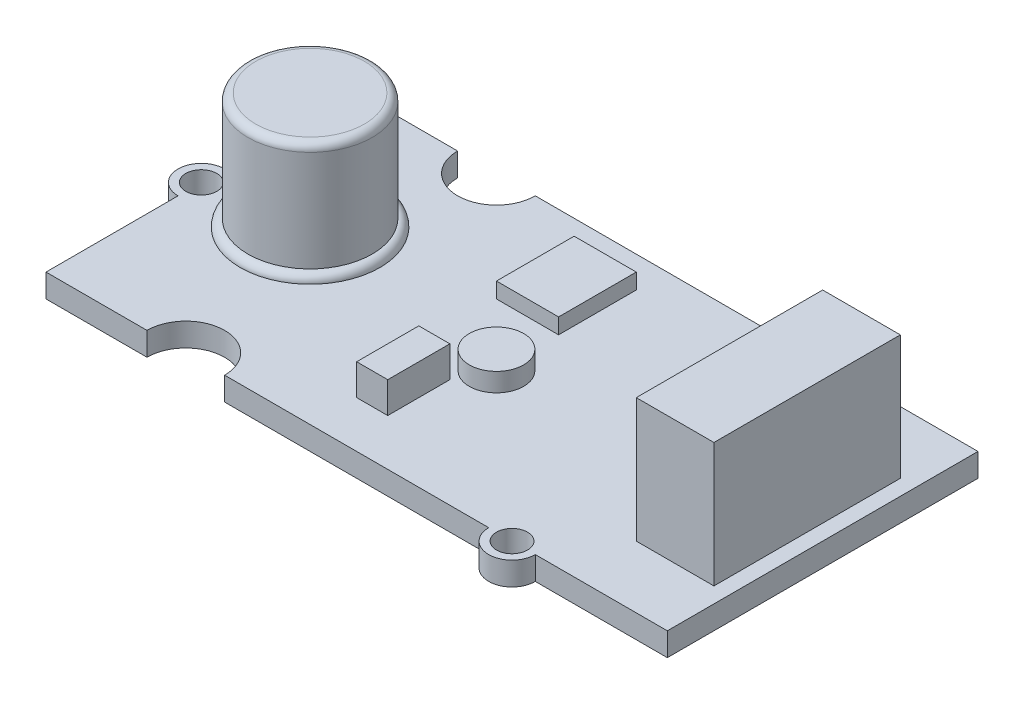
ISO-10303-21;
HEADER;
FILE_DESCRIPTION(('STEP AP214'),'2;1');
FILE_NAME('part.step','',(''),(''),'','','');
FILE_SCHEMA(('AUTOMOTIVE_DESIGN { 1 0 10303 214 1 1 1 1 }'));
ENDSEC;
DATA;
#1=APPLICATION_CONTEXT('core data for automotive mechanical design processes');
#2=APPLICATION_PROTOCOL_DEFINITION('international standard','automotive_design',2000,#1);
#3=PRODUCT_CONTEXT('',#1,'mechanical');
#4=PRODUCT('Part','Part','',(#3));
#5=PRODUCT_RELATED_PRODUCT_CATEGORY('part','',(#4));
#6=PRODUCT_DEFINITION_FORMATION('','',#4);
#7=PRODUCT_DEFINITION_CONTEXT('part definition',#1,'design');
#8=PRODUCT_DEFINITION('design','',#6,#7);
#9=PRODUCT_DEFINITION_SHAPE('','',#8);
#10=(LENGTH_UNIT() NAMED_UNIT(*) SI_UNIT(.MILLI.,.METRE.));
#11=(NAMED_UNIT(*) PLANE_ANGLE_UNIT() SI_UNIT($,.RADIAN.));
#12=(NAMED_UNIT(*) SI_UNIT($,.STERADIAN.) SOLID_ANGLE_UNIT());
#13=UNCERTAINTY_MEASURE_WITH_UNIT(LENGTH_MEASURE(1.E-05),#10,'distance_accuracy_value','');
#14=(GEOMETRIC_REPRESENTATION_CONTEXT(3) GLOBAL_UNCERTAINTY_ASSIGNED_CONTEXT((#13)) GLOBAL_UNIT_ASSIGNED_CONTEXT((#10,
#11,#12)) REPRESENTATION_CONTEXT('',''));
#15=CARTESIAN_POINT('',(0.,0.,0.));
#16=DIRECTION('',(0.,0.,1.));
#17=DIRECTION('',(1.,0.,0.));
#18=AXIS2_PLACEMENT_3D('',#15,#16,#17);
#19=CARTESIAN_POINT('',(0.,1.5,0.));
#20=DIRECTION('',(0.,1.,0.));
#21=DIRECTION('',(0.,0.,1.));
#22=AXIS2_PLACEMENT_3D('',#19,#20,#21);
#23=PLANE('',#22);
#24=CARTESIAN_POINT('',(0.,1.5,0.999999999999997));
#25=DIRECTION('',(0.,1.,0.));
#26=DIRECTION('',(0.,0.,1.));
#27=AXIS2_PLACEMENT_3D('',#24,#25,#26);
#28=CIRCLE('',#27,1.75);
#29=CARTESIAN_POINT('',(0.,1.5,2.75));
#30=VERTEX_POINT('',#29);
#31=EDGE_CURVE('E233',#30,#30,#28,.T.);
#32=ORIENTED_EDGE('',*,*,#31,.F.);
#33=EDGE_LOOP('',(#32));
#34=FACE_BOUND('',#33,.T.);
#35=CARTESIAN_POINT('',(-14.,1.5,-1.));
#36=DIRECTION('',(0.,1.,0.));
#37=DIRECTION('',(0.,0.,1.));
#38=AXIS2_PLACEMENT_3D('',#35,#36,#37);
#39=CIRCLE('',#38,4.5);
#40=CARTESIAN_POINT('',(-14.,1.5,3.5));
#41=VERTEX_POINT('',#40);
#42=EDGE_CURVE('E302',#41,#41,#39,.T.);
#43=ORIENTED_EDGE('',*,*,#42,.F.);
#44=EDGE_LOOP('',(#43));
#45=FACE_BOUND('',#44,.T.);
#46=CARTESIAN_POINT('',(10.,1.5,10.));
#47=DIRECTION('',(0.,1.,0.));
#48=DIRECTION('',(0.,0.,1.));
#49=AXIS2_PLACEMENT_3D('',#46,#47,#48);
#50=CIRCLE('',#49,0.999999999999999);
#51=CARTESIAN_POINT('',(10.,1.5,11.));
#52=VERTEX_POINT('',#51);
#53=EDGE_CURVE('E305',#52,#52,#50,.T.);
#54=ORIENTED_EDGE('',*,*,#53,.F.);
#55=EDGE_LOOP('',(#54));
#56=FACE_BOUND('',#55,.T.);
#57=CARTESIAN_POINT('',(10.,1.5,-10.));
#58=DIRECTION('',(0.,1.,0.));
#59=DIRECTION('',(0.,0.,1.));
#60=AXIS2_PLACEMENT_3D('',#57,#58,#59);
#61=CIRCLE('',#60,0.999999999999999);
#62=CARTESIAN_POINT('',(10.,1.5,-9.));
#63=VERTEX_POINT('',#62);
#64=EDGE_CURVE('E309',#63,#63,#61,.T.);
#65=ORIENTED_EDGE('',*,*,#64,.F.);
#66=EDGE_LOOP('',(#65));
#67=FACE_BOUND('',#66,.T.);
#68=DIRECTION('',(1.,0.,0.));
#69=VECTOR('',#68,1.);
#70=CARTESIAN_POINT('',(-20.,1.5,10.));
#71=LINE('',#70,#69);
#72=CARTESIAN_POINT('',(-8.5,1.5,10.));
#73=VERTEX_POINT('',#72);
#74=CARTESIAN_POINT('',(8.5,1.5,10.));
#75=VERTEX_POINT('',#74);
#76=EDGE_CURVE('E393',#73,#75,#71,.T.);
#77=ORIENTED_EDGE('',*,*,#76,.T.);
#78=CARTESIAN_POINT('',(10.,1.5,10.));
#79=DIRECTION('',(0.,1.,0.));
#80=DIRECTION('',(0.,0.,1.));
#81=AXIS2_PLACEMENT_3D('',#78,#79,#80);
#82=CIRCLE('',#81,1.5);
#83=CARTESIAN_POINT('',(11.5,1.5,10.));
#84=VERTEX_POINT('',#83);
#85=EDGE_CURVE('E315',#75,#84,#82,.T.);
#86=ORIENTED_EDGE('',*,*,#85,.T.);
#87=CARTESIAN_POINT('',(20.,1.5,10.));
#88=VERTEX_POINT('',#87);
#89=EDGE_CURVE('E388',#84,#88,#71,.T.);
#90=ORIENTED_EDGE('',*,*,#89,.T.);
#91=DIRECTION('',(0.,0.,-1.));
#92=VECTOR('',#91,1.);
#93=CARTESIAN_POINT('',(20.,1.5,-10.));
#94=LINE('',#93,#92);
#95=CARTESIAN_POINT('',(20.,1.5,-10.));
#96=VERTEX_POINT('',#95);
#97=EDGE_CURVE('E375',#88,#96,#94,.T.);
#98=ORIENTED_EDGE('',*,*,#97,.T.);
#99=DIRECTION('',(-1.,0.,0.));
#100=VECTOR('',#99,1.);
#101=CARTESIAN_POINT('',(-20.,1.5,-10.));
#102=LINE('',#101,#100);
#103=CARTESIAN_POINT('',(11.5,1.5,-10.));
#104=VERTEX_POINT('',#103);
#105=EDGE_CURVE('E380',#96,#104,#102,.T.);
#106=ORIENTED_EDGE('',*,*,#105,.T.);
#107=CARTESIAN_POINT('',(10.,1.5,-10.));
#108=DIRECTION('',(0.,1.,0.));
#109=DIRECTION('',(0.,0.,1.));
#110=AXIS2_PLACEMENT_3D('',#107,#108,#109);
#111=CIRCLE('',#110,1.5);
#112=CARTESIAN_POINT('',(8.5,1.5,-10.));
#113=VERTEX_POINT('',#112);
#114=EDGE_CURVE('E327',#104,#113,#111,.T.);
#115=ORIENTED_EDGE('',*,*,#114,.T.);
#116=CARTESIAN_POINT('',(-8.5,1.5,-10.));
#117=VERTEX_POINT('',#116);
#118=EDGE_CURVE('E384',#113,#117,#102,.T.);
#119=ORIENTED_EDGE('',*,*,#118,.T.);
#120=CARTESIAN_POINT('',(-11.,1.5,-10.));
#121=DIRECTION('',(0.,-1.,0.));
#122=DIRECTION('',(0.,0.,-1.));
#123=AXIS2_PLACEMENT_3D('',#120,#121,#122);
#124=CIRCLE('',#123,2.5);
#125=CARTESIAN_POINT('',(-13.5,1.5,-10.));
#126=VERTEX_POINT('',#125);
#127=EDGE_CURVE('E347',#117,#126,#124,.T.);
#128=ORIENTED_EDGE('',*,*,#127,.T.);
#129=CARTESIAN_POINT('',(-20.,1.5,-10.));
#130=VERTEX_POINT('',#129);
#131=EDGE_CURVE('E378',#126,#130,#102,.T.);
#132=ORIENTED_EDGE('',*,*,#131,.T.);
#133=DIRECTION('',(0.,0.,1.));
#134=VECTOR('',#133,1.);
#135=CARTESIAN_POINT('',(-20.,1.5,-10.));
#136=LINE('',#135,#134);
#137=CARTESIAN_POINT('',(-20.,1.5,-1.5));
#138=VERTEX_POINT('',#137);
#139=EDGE_CURVE('E385',#130,#138,#136,.T.);
#140=ORIENTED_EDGE('',*,*,#139,.T.);
#141=CARTESIAN_POINT('',(-20.,1.5,0.));
#142=DIRECTION('',(0.,-1.,0.));
#143=DIRECTION('',(0.,0.,-1.));
#144=AXIS2_PLACEMENT_3D('',#141,#142,#143);
#145=CIRCLE('',#144,1.5);
#146=CARTESIAN_POINT('',(-20.,1.5,1.5));
#147=VERTEX_POINT('',#146);
#148=EDGE_CURVE('E364',#147,#138,#145,.T.);
#149=ORIENTED_EDGE('',*,*,#148,.F.);
#150=CARTESIAN_POINT('',(-20.,1.5,10.));
#151=VERTEX_POINT('',#150);
#152=EDGE_CURVE('E383',#147,#151,#136,.T.);
#153=ORIENTED_EDGE('',*,*,#152,.T.);
#154=CARTESIAN_POINT('',(-13.5,1.5,10.));
#155=VERTEX_POINT('',#154);
#156=EDGE_CURVE('E389',#151,#155,#71,.T.);
#157=ORIENTED_EDGE('',*,*,#156,.T.);
#158=CARTESIAN_POINT('',(-11.,1.5,10.));
#159=DIRECTION('',(0.,-1.,0.));
#160=DIRECTION('',(0.,0.,-1.));
#161=AXIS2_PLACEMENT_3D('',#158,#159,#160);
#162=CIRCLE('',#161,2.5);
#163=EDGE_CURVE('E337',#155,#73,#162,.T.);
#164=ORIENTED_EDGE('',*,*,#163,.T.);
#165=EDGE_LOOP('',(#77,#86,#90,#98,#106,#115,#119,#128,#132,#140,#149,#153,#157,#164));
#166=FACE_BOUND('',#165,.T.);
#167=CARTESIAN_POINT('',(-20.,1.5,0.));
#168=DIRECTION('',(0.,-1.,0.));
#169=DIRECTION('',(0.,0.,-1.));
#170=AXIS2_PLACEMENT_3D('',#167,#168,#169);
#171=CIRCLE('',#170,1.);
#172=CARTESIAN_POINT('',(-20.,1.5,-1.));
#173=VERTEX_POINT('',#172);
#174=EDGE_CURVE('E358',#173,#173,#171,.T.);
#175=ORIENTED_EDGE('',*,*,#174,.T.);
#176=EDGE_LOOP('',(#175));
#177=FACE_BOUND('',#176,.T.);
#178=DIRECTION('',(-1.,0.,0.));
#179=VECTOR('',#178,1.);
#180=CARTESIAN_POINT('',(14.,1.5,-6.));
#181=LINE('',#180,#179);
#182=CARTESIAN_POINT('',(19.,1.5,-6.));
#183=VERTEX_POINT('',#182);
#184=CARTESIAN_POINT('',(14.,1.5,-6.));
#185=VERTEX_POINT('',#184);
#186=EDGE_CURVE('E284',#183,#185,#181,.T.);
#187=ORIENTED_EDGE('',*,*,#186,.F.);
#188=DIRECTION('',(0.,0.,-1.));
#189=VECTOR('',#188,1.);
#190=CARTESIAN_POINT('',(19.,1.5,-6.));
#191=LINE('',#190,#189);
#192=CARTESIAN_POINT('',(19.,1.5,6.));
#193=VERTEX_POINT('',#192);
#194=EDGE_CURVE('E270',#193,#183,#191,.T.);
#195=ORIENTED_EDGE('',*,*,#194,.F.);
#196=DIRECTION('',(1.,0.,0.));
#197=VECTOR('',#196,1.);
#198=CARTESIAN_POINT('',(14.,1.5,6.));
#199=LINE('',#198,#197);
#200=CARTESIAN_POINT('',(14.,1.5,6.));
#201=VERTEX_POINT('',#200);
#202=EDGE_CURVE('E275',#201,#193,#199,.T.);
#203=ORIENTED_EDGE('',*,*,#202,.F.);
#204=DIRECTION('',(0.,0.,1.));
#205=VECTOR('',#204,1.);
#206=CARTESIAN_POINT('',(14.,1.5,-6.));
#207=LINE('',#206,#205);
#208=EDGE_CURVE('E286',#185,#201,#207,.T.);
#209=ORIENTED_EDGE('',*,*,#208,.F.);
#210=EDGE_LOOP('',(#187,#195,#203,#209));
#211=FACE_BOUND('',#210,.T.);
#212=DIRECTION('',(-1.,0.,0.));
#213=VECTOR('',#212,1.);
#214=CARTESIAN_POINT('',(-4.,1.5,-8.));
#215=LINE('',#214,#213);
#216=CARTESIAN_POINT('',(0.,1.5,-8.));
#217=VERTEX_POINT('',#216);
#218=CARTESIAN_POINT('',(-4.,1.5,-8.));
#219=VERTEX_POINT('',#218);
#220=EDGE_CURVE('E257',#217,#219,#215,.T.);
#221=ORIENTED_EDGE('',*,*,#220,.F.);
#222=DIRECTION('',(0.,0.,-1.));
#223=VECTOR('',#222,1.);
#224=CARTESIAN_POINT('',(0.,1.5,-8.));
#225=LINE('',#224,#223);
#226=CARTESIAN_POINT('',(0.,1.5,-3.));
#227=VERTEX_POINT('',#226);
#228=EDGE_CURVE('E242',#227,#217,#225,.T.);
#229=ORIENTED_EDGE('',*,*,#228,.F.);
#230=DIRECTION('',(1.,0.,0.));
#231=VECTOR('',#230,1.);
#232=CARTESIAN_POINT('',(-4.,1.5,-3.));
#233=LINE('',#232,#231);
#234=CARTESIAN_POINT('',(-4.,1.5,-3.));
#235=VERTEX_POINT('',#234);
#236=EDGE_CURVE('E248',#235,#227,#233,.T.);
#237=ORIENTED_EDGE('',*,*,#236,.F.);
#238=DIRECTION('',(0.,0.,1.));
#239=VECTOR('',#238,1.);
#240=CARTESIAN_POINT('',(-4.,1.5,-8.));
#241=LINE('',#240,#239);
#242=EDGE_CURVE('E259',#219,#235,#241,.T.);
#243=ORIENTED_EDGE('',*,*,#242,.F.);
#244=EDGE_LOOP('',(#221,#229,#237,#243));
#245=FACE_BOUND('',#244,.T.);
#246=DIRECTION('',(-1.,0.,0.));
#247=VECTOR('',#246,1.);
#248=CARTESIAN_POINT('',(-3.,1.5,3.));
#249=LINE('',#248,#247);
#250=CARTESIAN_POINT('',(-0.999999999999997,1.5,3.));
#251=VERTEX_POINT('',#250);
#252=CARTESIAN_POINT('',(-3.,1.5,3.));
#253=VERTEX_POINT('',#252);
#254=EDGE_CURVE('E544',#251,#253,#249,.T.);
#255=ORIENTED_EDGE('',*,*,#254,.F.);
#256=DIRECTION('',(0.,0.,-1.));
#257=VECTOR('',#256,1.);
#258=CARTESIAN_POINT('',(-0.999999999999997,1.5,3.));
#259=LINE('',#258,#257);
#260=CARTESIAN_POINT('',(-0.999999999999997,1.5,7.));
#261=VERTEX_POINT('',#260);
#262=EDGE_CURVE('E231',#261,#251,#259,.T.);
#263=ORIENTED_EDGE('',*,*,#262,.F.);
#264=DIRECTION('',(1.,0.,0.));
#265=VECTOR('',#264,1.);
#266=CARTESIAN_POINT('',(-3.,1.5,7.));
#267=LINE('',#266,#265);
#268=CARTESIAN_POINT('',(-3.,1.5,7.));
#269=VERTEX_POINT('',#268);
#270=EDGE_CURVE('E227',#269,#261,#267,.T.);
#271=ORIENTED_EDGE('',*,*,#270,.F.);
#272=DIRECTION('',(0.,0.,1.));
#273=VECTOR('',#272,1.);
#274=CARTESIAN_POINT('',(-3.,1.5,3.));
#275=LINE('',#274,#273);
#276=EDGE_CURVE('E546',#253,#269,#275,.T.);
#277=ORIENTED_EDGE('',*,*,#276,.F.);
#278=EDGE_LOOP('',(#255,#263,#271,#277));
#279=FACE_BOUND('',#278,.T.);
#280=ADVANCED_FACE('F34',(#34,#45,#56,#67,#166,#177,#211,#245,#279),#23,.T.);
#281=CARTESIAN_POINT('',(-20.,1.5,10.));
#282=DIRECTION('',(0.,0.,-1.));
#283=DIRECTION('',(-1.,0.,0.));
#284=AXIS2_PLACEMENT_3D('',#281,#282,#283);
#285=PLANE('',#284);
#286=DIRECTION('',(1.,0.,0.));
#287=VECTOR('',#286,1.);
#288=CARTESIAN_POINT('',(-20.,0.,10.));
#289=LINE('',#288,#287);
#290=CARTESIAN_POINT('',(-8.5,0.,10.));
#291=VERTEX_POINT('',#290);
#292=CARTESIAN_POINT('',(8.5,0.,10.));
#293=VERTEX_POINT('',#292);
#294=EDGE_CURVE('E407',#291,#293,#289,.T.);
#295=ORIENTED_EDGE('',*,*,#294,.T.);
#296=DIRECTION('',(0.,1.,0.));
#297=VECTOR('',#296,1.);
#298=CARTESIAN_POINT('',(8.5,0.,10.));
#299=LINE('',#298,#297);
#300=EDGE_CURVE('E324',#293,#75,#299,.T.);
#301=ORIENTED_EDGE('',*,*,#300,.T.);
#302=ORIENTED_EDGE('',*,*,#76,.F.);
#303=DIRECTION('',(0.,-1.,0.));
#304=VECTOR('',#303,1.);
#305=CARTESIAN_POINT('',(-8.5,1.5,10.));
#306=LINE('',#305,#304);
#307=EDGE_CURVE('E343',#73,#291,#306,.T.);
#308=ORIENTED_EDGE('',*,*,#307,.T.);
#309=EDGE_LOOP('',(#295,#301,#302,#308));
#310=FACE_BOUND('',#309,.T.);
#311=ADVANCED_FACE('F440',(#310),#285,.F.);
#312=CARTESIAN_POINT('',(-20.,1.5,-10.));
#313=DIRECTION('',(0.,0.,1.));
#314=DIRECTION('',(1.,0.,0.));
#315=AXIS2_PLACEMENT_3D('',#312,#313,#314);
#316=PLANE('',#315);
#317=DIRECTION('',(-1.,0.,0.));
#318=VECTOR('',#317,1.);
#319=CARTESIAN_POINT('',(-20.,0.,-10.));
#320=LINE('',#319,#318);
#321=CARTESIAN_POINT('',(20.,0.,-10.));
#322=VERTEX_POINT('',#321);
#323=CARTESIAN_POINT('',(11.5,0.,-10.));
#324=VERTEX_POINT('',#323);
#325=EDGE_CURVE('E397',#322,#324,#320,.T.);
#326=ORIENTED_EDGE('',*,*,#325,.T.);
#327=DIRECTION('',(0.,1.,0.));
#328=VECTOR('',#327,1.);
#329=CARTESIAN_POINT('',(11.5,0.,-10.));
#330=LINE('',#329,#328);
#331=EDGE_CURVE('E334',#324,#104,#330,.T.);
#332=ORIENTED_EDGE('',*,*,#331,.T.);
#333=ORIENTED_EDGE('',*,*,#105,.F.);
#334=DIRECTION('',(0.,-1.,0.));
#335=VECTOR('',#334,1.);
#336=CARTESIAN_POINT('',(20.,1.5,-10.));
#337=LINE('',#336,#335);
#338=EDGE_CURVE('E416',#96,#322,#337,.T.);
#339=ORIENTED_EDGE('',*,*,#338,.T.);
#340=EDGE_LOOP('',(#326,#332,#333,#339));
#341=FACE_BOUND('',#340,.T.);
#342=ADVANCED_FACE('F446',(#341),#316,.F.);
#343=ORIENTED_EDGE('',*,*,#89,.F.);
#344=DIRECTION('',(0.,1.,0.));
#345=VECTOR('',#344,1.);
#346=CARTESIAN_POINT('',(11.5,0.,10.));
#347=LINE('',#346,#345);
#348=CARTESIAN_POINT('',(11.5,0.,10.));
#349=VERTEX_POINT('',#348);
#350=EDGE_CURVE('E320',#84,#349,#347,.F.);
#351=ORIENTED_EDGE('',*,*,#350,.T.);
#352=CARTESIAN_POINT('',(20.,0.,10.));
#353=VERTEX_POINT('',#352);
#354=EDGE_CURVE('E404',#349,#353,#289,.T.);
#355=ORIENTED_EDGE('',*,*,#354,.T.);
#356=DIRECTION('',(0.,-1.,0.));
#357=VECTOR('',#356,1.);
#358=CARTESIAN_POINT('',(20.,1.5,10.));
#359=LINE('',#358,#357);
#360=EDGE_CURVE('E392',#88,#353,#359,.T.);
#361=ORIENTED_EDGE('',*,*,#360,.F.);
#362=EDGE_LOOP('',(#343,#351,#355,#361));
#363=FACE_BOUND('',#362,.T.);
#364=ADVANCED_FACE('F449',(#363),#285,.F.);
#365=ORIENTED_EDGE('',*,*,#131,.F.);
#366=DIRECTION('',(0.,-1.,0.));
#367=VECTOR('',#366,1.);
#368=CARTESIAN_POINT('',(-13.5,1.5,-10.));
#369=LINE('',#368,#367);
#370=CARTESIAN_POINT('',(-13.5,0.,-10.));
#371=VERTEX_POINT('',#370);
#372=EDGE_CURVE('E354',#126,#371,#369,.T.);
#373=ORIENTED_EDGE('',*,*,#372,.T.);
#374=CARTESIAN_POINT('',(-20.,0.,-10.));
#375=VERTEX_POINT('',#374);
#376=EDGE_CURVE('E396',#371,#375,#320,.T.);
#377=ORIENTED_EDGE('',*,*,#376,.T.);
#378=DIRECTION('',(0.,-1.,0.));
#379=VECTOR('',#378,1.);
#380=CARTESIAN_POINT('',(-20.,1.5,-10.));
#381=LINE('',#380,#379);
#382=EDGE_CURVE('E413',#130,#375,#381,.T.);
#383=ORIENTED_EDGE('',*,*,#382,.F.);
#384=EDGE_LOOP('',(#365,#373,#377,#383));
#385=FACE_BOUND('',#384,.T.);
#386=ADVANCED_FACE('F472',(#385),#316,.F.);
#387=CARTESIAN_POINT('',(-20.,1.5,-10.));
#388=DIRECTION('',(1.,0.,0.));
#389=DIRECTION('',(0.,0.,-1.));
#390=AXIS2_PLACEMENT_3D('',#387,#388,#389);
#391=PLANE('',#390);
#392=ORIENTED_EDGE('',*,*,#152,.F.);
#393=DIRECTION('',(0.,-1.,0.));
#394=VECTOR('',#393,1.);
#395=CARTESIAN_POINT('',(-20.,1.5,1.5));
#396=LINE('',#395,#394);
#397=CARTESIAN_POINT('',(-20.,0.,1.5));
#398=VERTEX_POINT('',#397);
#399=EDGE_CURVE('E371',#147,#398,#396,.T.);
#400=ORIENTED_EDGE('',*,*,#399,.T.);
#401=DIRECTION('',(0.,0.,1.));
#402=VECTOR('',#401,1.);
#403=CARTESIAN_POINT('',(-20.,0.,-10.));
#404=LINE('',#403,#402);
#405=CARTESIAN_POINT('',(-20.,0.,10.));
#406=VERTEX_POINT('',#405);
#407=EDGE_CURVE('E400',#398,#406,#404,.T.);
#408=ORIENTED_EDGE('',*,*,#407,.T.);
#409=DIRECTION('',(0.,-1.,0.));
#410=VECTOR('',#409,1.);
#411=CARTESIAN_POINT('',(-20.,1.5,10.));
#412=LINE('',#411,#410);
#413=EDGE_CURVE('E410',#151,#406,#412,.T.);
#414=ORIENTED_EDGE('',*,*,#413,.F.);
#415=EDGE_LOOP('',(#392,#400,#408,#414));
#416=FACE_BOUND('',#415,.T.);
#417=ADVANCED_FACE('F468',(#416),#391,.F.);
#418=CARTESIAN_POINT('',(20.,1.5,-10.));
#419=DIRECTION('',(-1.,0.,0.));
#420=DIRECTION('',(0.,0.,1.));
#421=AXIS2_PLACEMENT_3D('',#418,#419,#420);
#422=PLANE('',#421);
#423=DIRECTION('',(0.,0.,-1.));
#424=VECTOR('',#423,1.);
#425=CARTESIAN_POINT('',(20.,0.,-10.));
#426=LINE('',#425,#424);
#427=EDGE_CURVE('E374',#353,#322,#426,.T.);
#428=ORIENTED_EDGE('',*,*,#427,.T.);
#429=ORIENTED_EDGE('',*,*,#338,.F.);
#430=ORIENTED_EDGE('',*,*,#97,.F.);
#431=ORIENTED_EDGE('',*,*,#360,.T.);
#432=EDGE_LOOP('',(#428,#429,#430,#431));
#433=FACE_BOUND('',#432,.T.);
#434=ADVANCED_FACE('F470',(#433),#422,.F.);
#435=ORIENTED_EDGE('',*,*,#118,.F.);
#436=DIRECTION('',(0.,1.,0.));
#437=VECTOR('',#436,1.);
#438=CARTESIAN_POINT('',(8.5,0.,-10.));
#439=LINE('',#438,#437);
#440=CARTESIAN_POINT('',(8.5,0.,-10.));
#441=VERTEX_POINT('',#440);
#442=EDGE_CURVE('E330',#113,#441,#439,.F.);
#443=ORIENTED_EDGE('',*,*,#442,.T.);
#444=CARTESIAN_POINT('',(-8.5,0.,-10.));
#445=VERTEX_POINT('',#444);
#446=EDGE_CURVE('E401',#441,#445,#320,.T.);
#447=ORIENTED_EDGE('',*,*,#446,.T.);
#448=DIRECTION('',(0.,-1.,0.));
#449=VECTOR('',#448,1.);
#450=CARTESIAN_POINT('',(-8.5,1.5,-10.));
#451=LINE('',#450,#449);
#452=EDGE_CURVE('E350',#445,#117,#451,.F.);
#453=ORIENTED_EDGE('',*,*,#452,.T.);
#454=EDGE_LOOP('',(#435,#443,#447,#453));
#455=FACE_BOUND('',#454,.T.);
#456=ADVANCED_FACE('F466',(#455),#316,.F.);
#457=CARTESIAN_POINT('',(-20.,0.,-1.5));
#458=VERTEX_POINT('',#457);
#459=EDGE_CURVE('E402',#375,#458,#404,.T.);
#460=ORIENTED_EDGE('',*,*,#459,.T.);
#461=DIRECTION('',(0.,-1.,0.));
#462=VECTOR('',#461,1.);
#463=CARTESIAN_POINT('',(-20.,1.5,-1.5));
#464=LINE('',#463,#462);
#465=EDGE_CURVE('E367',#458,#138,#464,.F.);
#466=ORIENTED_EDGE('',*,*,#465,.T.);
#467=ORIENTED_EDGE('',*,*,#139,.F.);
#468=ORIENTED_EDGE('',*,*,#382,.T.);
#469=EDGE_LOOP('',(#460,#466,#467,#468));
#470=FACE_BOUND('',#469,.T.);
#471=ADVANCED_FACE('F462',(#470),#391,.F.);
#472=CARTESIAN_POINT('',(-13.5,0.,10.));
#473=VERTEX_POINT('',#472);
#474=EDGE_CURVE('E379',#406,#473,#289,.T.);
#475=ORIENTED_EDGE('',*,*,#474,.T.);
#476=DIRECTION('',(0.,-1.,0.));
#477=VECTOR('',#476,1.);
#478=CARTESIAN_POINT('',(-13.5,1.5,10.));
#479=LINE('',#478,#477);
#480=EDGE_CURVE('E340',#473,#155,#479,.F.);
#481=ORIENTED_EDGE('',*,*,#480,.T.);
#482=ORIENTED_EDGE('',*,*,#156,.F.);
#483=ORIENTED_EDGE('',*,*,#413,.T.);
#484=EDGE_LOOP('',(#475,#481,#482,#483));
#485=FACE_BOUND('',#484,.T.);
#486=ADVANCED_FACE('F450',(#485),#285,.F.);
#487=CARTESIAN_POINT('',(0.,0.,0.));
#488=DIRECTION('',(0.,1.,0.));
#489=DIRECTION('',(0.,0.,1.));
#490=AXIS2_PLACEMENT_3D('',#487,#488,#489);
#491=PLANE('',#490);
#492=CARTESIAN_POINT('',(10.,0.,10.));
#493=DIRECTION('',(0.,1.,0.));
#494=DIRECTION('',(0.,0.,1.));
#495=AXIS2_PLACEMENT_3D('',#492,#493,#494);
#496=CIRCLE('',#495,0.999999999999999);
#497=CARTESIAN_POINT('',(10.,0.,11.));
#498=VERTEX_POINT('',#497);
#499=EDGE_CURVE('E306',#498,#498,#496,.T.);
#500=ORIENTED_EDGE('',*,*,#499,.T.);
#501=EDGE_LOOP('',(#500));
#502=FACE_BOUND('',#501,.T.);
#503=CARTESIAN_POINT('',(10.,0.,-10.));
#504=DIRECTION('',(0.,1.,0.));
#505=DIRECTION('',(0.,0.,1.));
#506=AXIS2_PLACEMENT_3D('',#503,#504,#505);
#507=CIRCLE('',#506,0.999999999999999);
#508=CARTESIAN_POINT('',(10.,0.,-9.));
#509=VERTEX_POINT('',#508);
#510=EDGE_CURVE('E312',#509,#509,#507,.T.);
#511=ORIENTED_EDGE('',*,*,#510,.T.);
#512=EDGE_LOOP('',(#511));
#513=FACE_BOUND('',#512,.T.);
#514=CARTESIAN_POINT('',(-20.,0.,0.));
#515=DIRECTION('',(0.,-1.,0.));
#516=DIRECTION('',(0.,0.,-1.));
#517=AXIS2_PLACEMENT_3D('',#514,#515,#516);
#518=CIRCLE('',#517,1.);
#519=CARTESIAN_POINT('',(-20.,0.,-1.));
#520=VERTEX_POINT('',#519);
#521=EDGE_CURVE('E357',#520,#520,#518,.T.);
#522=ORIENTED_EDGE('',*,*,#521,.F.);
#523=EDGE_LOOP('',(#522));
#524=FACE_BOUND('',#523,.T.);
#525=ORIENTED_EDGE('',*,*,#354,.F.);
#526=CARTESIAN_POINT('',(10.,0.,10.));
#527=DIRECTION('',(0.,1.,0.));
#528=DIRECTION('',(0.,0.,1.));
#529=AXIS2_PLACEMENT_3D('',#526,#527,#528);
#530=CIRCLE('',#529,1.5);
#531=EDGE_CURVE('E318',#293,#349,#530,.T.);
#532=ORIENTED_EDGE('',*,*,#531,.F.);
#533=ORIENTED_EDGE('',*,*,#294,.F.);
#534=CARTESIAN_POINT('',(-11.,0.,10.));
#535=DIRECTION('',(0.,1.,0.));
#536=DIRECTION('',(0.,0.,1.));
#537=AXIS2_PLACEMENT_3D('',#534,#535,#536);
#538=CIRCLE('',#537,2.5);
#539=EDGE_CURVE('E419',#291,#473,#538,.T.);
#540=ORIENTED_EDGE('',*,*,#539,.T.);
#541=ORIENTED_EDGE('',*,*,#474,.F.);
#542=ORIENTED_EDGE('',*,*,#407,.F.);
#543=CARTESIAN_POINT('',(-20.,0.,0.));
#544=DIRECTION('',(0.,-1.,0.));
#545=DIRECTION('',(0.,0.,-1.));
#546=AXIS2_PLACEMENT_3D('',#543,#544,#545);
#547=CIRCLE('',#546,1.5);
#548=EDGE_CURVE('E361',#398,#458,#547,.T.);
#549=ORIENTED_EDGE('',*,*,#548,.T.);
#550=ORIENTED_EDGE('',*,*,#459,.F.);
#551=ORIENTED_EDGE('',*,*,#376,.F.);
#552=CARTESIAN_POINT('',(-11.,0.,-10.));
#553=DIRECTION('',(0.,-1.,0.));
#554=DIRECTION('',(0.,0.,-1.));
#555=AXIS2_PLACEMENT_3D('',#552,#553,#554);
#556=CIRCLE('',#555,2.5);
#557=EDGE_CURVE('E346',#445,#371,#556,.T.);
#558=ORIENTED_EDGE('',*,*,#557,.F.);
#559=ORIENTED_EDGE('',*,*,#446,.F.);
#560=CARTESIAN_POINT('',(10.,0.,-10.));
#561=DIRECTION('',(0.,1.,0.));
#562=DIRECTION('',(0.,0.,1.));
#563=AXIS2_PLACEMENT_3D('',#560,#561,#562);
#564=CIRCLE('',#563,1.5);
#565=EDGE_CURVE('E328',#324,#441,#564,.T.);
#566=ORIENTED_EDGE('',*,*,#565,.F.);
#567=ORIENTED_EDGE('',*,*,#325,.F.);
#568=ORIENTED_EDGE('',*,*,#427,.F.);
#569=EDGE_LOOP('',(#525,#532,#533,#540,#541,#542,#549,#550,#551,#558,#559,#566,#567,#568));
#570=FACE_BOUND('',#569,.T.);
#571=ADVANCED_FACE('F457',(#502,#513,#524,#570),#491,.F.);
#572=CARTESIAN_POINT('',(-20.,1.5,0.));
#573=DIRECTION('',(0.,-1.,0.));
#574=DIRECTION('',(0.,0.,-1.));
#575=AXIS2_PLACEMENT_3D('',#572,#573,#574);
#576=CYLINDRICAL_SURFACE('',#575,1.5);
#577=ORIENTED_EDGE('',*,*,#399,.F.);
#578=ORIENTED_EDGE('',*,*,#148,.T.);
#579=ORIENTED_EDGE('',*,*,#465,.F.);
#580=ORIENTED_EDGE('',*,*,#548,.F.);
#581=EDGE_LOOP('',(#577,#578,#579,#580));
#582=FACE_BOUND('',#581,.T.);
#583=ADVANCED_FACE('F455',(#582),#576,.T.);
#584=CARTESIAN_POINT('',(-20.,1.5,0.));
#585=DIRECTION('',(0.,-1.,0.));
#586=DIRECTION('',(0.,0.,-1.));
#587=AXIS2_PLACEMENT_3D('',#584,#585,#586);
#588=CYLINDRICAL_SURFACE('',#587,1.);
#589=ORIENTED_EDGE('',*,*,#174,.F.);
#590=EDGE_LOOP('',(#589));
#591=FACE_BOUND('',#590,.T.);
#592=ORIENTED_EDGE('',*,*,#521,.T.);
#593=EDGE_LOOP('',(#592));
#594=FACE_BOUND('',#593,.T.);
#595=ADVANCED_FACE('F522',(#591,#594),#588,.F.);
#596=CARTESIAN_POINT('',(-11.,1.5,-10.));
#597=DIRECTION('',(0.,-1.,0.));
#598=DIRECTION('',(0.,0.,-1.));
#599=AXIS2_PLACEMENT_3D('',#596,#597,#598);
#600=CYLINDRICAL_SURFACE('',#599,2.5);
#601=ORIENTED_EDGE('',*,*,#127,.F.);
#602=ORIENTED_EDGE('',*,*,#452,.F.);
#603=ORIENTED_EDGE('',*,*,#557,.T.);
#604=ORIENTED_EDGE('',*,*,#372,.F.);
#605=EDGE_LOOP('',(#601,#602,#603,#604));
#606=FACE_BOUND('',#605,.T.);
#607=ADVANCED_FACE('F519',(#606),#600,.F.);
#608=CARTESIAN_POINT('',(-11.,1.5,10.));
#609=DIRECTION('',(0.,-1.,0.));
#610=DIRECTION('',(0.,0.,-1.));
#611=AXIS2_PLACEMENT_3D('',#608,#609,#610);
#612=CYLINDRICAL_SURFACE('',#611,2.5);
#613=ORIENTED_EDGE('',*,*,#163,.F.);
#614=ORIENTED_EDGE('',*,*,#480,.F.);
#615=ORIENTED_EDGE('',*,*,#539,.F.);
#616=ORIENTED_EDGE('',*,*,#307,.F.);
#617=EDGE_LOOP('',(#613,#614,#615,#616));
#618=FACE_BOUND('',#617,.T.);
#619=ADVANCED_FACE('F512',(#618),#612,.F.);
#620=CARTESIAN_POINT('',(10.,0.,-10.));
#621=DIRECTION('',(0.,1.,0.));
#622=DIRECTION('',(0.,0.,1.));
#623=AXIS2_PLACEMENT_3D('',#620,#621,#622);
#624=CYLINDRICAL_SURFACE('',#623,1.5);
#625=ORIENTED_EDGE('',*,*,#331,.F.);
#626=ORIENTED_EDGE('',*,*,#565,.T.);
#627=ORIENTED_EDGE('',*,*,#442,.F.);
#628=ORIENTED_EDGE('',*,*,#114,.F.);
#629=EDGE_LOOP('',(#625,#626,#627,#628));
#630=FACE_BOUND('',#629,.T.);
#631=ADVANCED_FACE('F503',(#630),#624,.T.);
#632=CARTESIAN_POINT('',(10.,0.,10.));
#633=DIRECTION('',(0.,1.,0.));
#634=DIRECTION('',(0.,0.,1.));
#635=AXIS2_PLACEMENT_3D('',#632,#633,#634);
#636=CYLINDRICAL_SURFACE('',#635,1.5);
#637=ORIENTED_EDGE('',*,*,#300,.F.);
#638=ORIENTED_EDGE('',*,*,#531,.T.);
#639=ORIENTED_EDGE('',*,*,#350,.F.);
#640=ORIENTED_EDGE('',*,*,#85,.F.);
#641=EDGE_LOOP('',(#637,#638,#639,#640));
#642=FACE_BOUND('',#641,.T.);
#643=ADVANCED_FACE('F500',(#642),#636,.T.);
#644=CARTESIAN_POINT('',(10.,0.,-10.));
#645=DIRECTION('',(0.,1.,0.));
#646=DIRECTION('',(0.,0.,1.));
#647=AXIS2_PLACEMENT_3D('',#644,#645,#646);
#648=CYLINDRICAL_SURFACE('',#647,0.999999999999999);
#649=ORIENTED_EDGE('',*,*,#510,.F.);
#650=EDGE_LOOP('',(#649));
#651=FACE_BOUND('',#650,.T.);
#652=ORIENTED_EDGE('',*,*,#64,.T.);
#653=EDGE_LOOP('',(#652));
#654=FACE_BOUND('',#653,.T.);
#655=ADVANCED_FACE('F502',(#651,#654),#648,.F.);
#656=CARTESIAN_POINT('',(10.,0.,10.));
#657=DIRECTION('',(0.,1.,0.));
#658=DIRECTION('',(0.,0.,1.));
#659=AXIS2_PLACEMENT_3D('',#656,#657,#658);
#660=CYLINDRICAL_SURFACE('',#659,0.999999999999999);
#661=ORIENTED_EDGE('',*,*,#499,.F.);
#662=EDGE_LOOP('',(#661));
#663=FACE_BOUND('',#662,.T.);
#664=ORIENTED_EDGE('',*,*,#53,.T.);
#665=EDGE_LOOP('',(#664));
#666=FACE_BOUND('',#665,.T.);
#667=ADVANCED_FACE('F509',(#663,#666),#660,.F.);
#668=CARTESIAN_POINT('',(-14.,9.,-1.));
#669=DIRECTION('',(0.,-1.,0.));
#670=DIRECTION('',(0.,0.,-1.));
#671=AXIS2_PLACEMENT_3D('',#668,#669,#670);
#672=CYLINDRICAL_SURFACE('',#671,4.);
#673=CARTESIAN_POINT('',(-14.,8.5,-1.));
#674=DIRECTION('',(0.,1.,0.));
#675=DIRECTION('',(0.,0.,1.));
#676=AXIS2_PLACEMENT_3D('',#673,#674,#675);
#677=CIRCLE('',#676,4.);
#678=CARTESIAN_POINT('',(-14.,8.5,3.));
#679=VERTEX_POINT('',#678);
#680=EDGE_CURVE('E11',#679,#679,#677,.F.);
#681=ORIENTED_EDGE('',*,*,#680,.T.);
#682=EDGE_LOOP('',(#681));
#683=FACE_BOUND('',#682,.T.);
#684=CARTESIAN_POINT('',(-14.,2.,-1.));
#685=DIRECTION('',(0.,1.,0.));
#686=DIRECTION('',(0.,0.,1.));
#687=AXIS2_PLACEMENT_3D('',#684,#685,#686);
#688=CIRCLE('',#687,4.);
#689=CARTESIAN_POINT('',(-14.,2.,3.));
#690=VERTEX_POINT('',#689);
#691=EDGE_CURVE('E299',#690,#690,#688,.T.);
#692=ORIENTED_EDGE('',*,*,#691,.T.);
#693=EDGE_LOOP('',(#692));
#694=FACE_BOUND('',#693,.T.);
#695=ADVANCED_FACE('F435',(#683,#694),#672,.T.);
#696=CARTESIAN_POINT('',(-14.,9.,-1.));
#697=DIRECTION('',(0.,1.,0.));
#698=DIRECTION('',(0.,0.,1.));
#699=AXIS2_PLACEMENT_3D('',#696,#697,#698);
#700=PLANE('',#699);
#701=CARTESIAN_POINT('',(-14.,9.,-1.));
#702=DIRECTION('',(0.,1.,0.));
#703=DIRECTION('',(0.,0.,1.));
#704=AXIS2_PLACEMENT_3D('',#701,#702,#703);
#705=CIRCLE('',#704,3.5);
#706=CARTESIAN_POINT('',(-14.,9.,2.5));
#707=VERTEX_POINT('',#706);
#708=EDGE_CURVE('E42',#707,#707,#705,.T.);
#709=ORIENTED_EDGE('',*,*,#708,.T.);
#710=EDGE_LOOP('',(#709));
#711=FACE_BOUND('',#710,.T.);
#712=ADVANCED_FACE('F424',(#711),#700,.T.);
#713=CARTESIAN_POINT('',(-14.,8.5,-1.));
#714=DIRECTION('',(0.,1.,0.));
#715=DIRECTION('',(0.,0.,1.));
#716=AXIS2_PLACEMENT_3D('',#713,#714,#715);
#717=TOROIDAL_SURFACE('',#716,3.5,0.5);
#718=ORIENTED_EDGE('',*,*,#680,.F.);
#719=EDGE_LOOP('',(#718));
#720=FACE_BOUND('',#719,.T.);
#721=ORIENTED_EDGE('',*,*,#708,.F.);
#722=EDGE_LOOP('',(#721));
#723=FACE_BOUND('',#722,.T.);
#724=ADVANCED_FACE('F426',(#720,#723),#717,.T.);
#725=CARTESIAN_POINT('',(-14.,1.5,-1.));
#726=DIRECTION('',(0.,1.,0.));
#727=DIRECTION('',(0.,0.,1.));
#728=AXIS2_PLACEMENT_3D('',#725,#726,#727);
#729=TOROIDAL_SURFACE('',#728,4.,0.5);
#730=ORIENTED_EDGE('',*,*,#42,.T.);
#731=EDGE_LOOP('',(#730));
#732=FACE_BOUND('',#731,.T.);
#733=ORIENTED_EDGE('',*,*,#691,.F.);
#734=EDGE_LOOP('',(#733));
#735=FACE_BOUND('',#734,.T.);
#736=ADVANCED_FACE('F36',(#732,#735),#729,.T.);
#737=CARTESIAN_POINT('',(19.,9.5,-6.));
#738=DIRECTION('',(-1.,0.,0.));
#739=DIRECTION('',(0.,0.,1.));
#740=AXIS2_PLACEMENT_3D('',#737,#738,#739);
#741=PLANE('',#740);
#742=ORIENTED_EDGE('',*,*,#194,.T.);
#743=DIRECTION('',(0.,-1.,0.));
#744=VECTOR('',#743,1.);
#745=CARTESIAN_POINT('',(19.,9.5,-6.));
#746=LINE('',#745,#744);
#747=CARTESIAN_POINT('',(19.,9.5,-6.));
#748=VERTEX_POINT('',#747);
#749=EDGE_CURVE('E297',#748,#183,#746,.T.);
#750=ORIENTED_EDGE('',*,*,#749,.F.);
#751=DIRECTION('',(0.,0.,-1.));
#752=VECTOR('',#751,1.);
#753=CARTESIAN_POINT('',(19.,9.5,-6.));
#754=LINE('',#753,#752);
#755=CARTESIAN_POINT('',(19.,9.5,6.));
#756=VERTEX_POINT('',#755);
#757=EDGE_CURVE('E271',#756,#748,#754,.T.);
#758=ORIENTED_EDGE('',*,*,#757,.F.);
#759=DIRECTION('',(0.,-1.,0.));
#760=VECTOR('',#759,1.);
#761=CARTESIAN_POINT('',(19.,9.5,6.));
#762=LINE('',#761,#760);
#763=EDGE_CURVE('E281',#756,#193,#762,.T.);
#764=ORIENTED_EDGE('',*,*,#763,.T.);
#765=EDGE_LOOP('',(#742,#750,#758,#764));
#766=FACE_BOUND('',#765,.T.);
#767=ADVANCED_FACE('F433',(#766),#741,.F.);
#768=CARTESIAN_POINT('',(14.,9.5,-6.));
#769=DIRECTION('',(0.,0.,1.));
#770=DIRECTION('',(1.,0.,0.));
#771=AXIS2_PLACEMENT_3D('',#768,#769,#770);
#772=PLANE('',#771);
#773=ORIENTED_EDGE('',*,*,#186,.T.);
#774=DIRECTION('',(0.,-1.,0.));
#775=VECTOR('',#774,1.);
#776=CARTESIAN_POINT('',(14.,9.5,-6.));
#777=LINE('',#776,#775);
#778=CARTESIAN_POINT('',(14.,9.5,-6.));
#779=VERTEX_POINT('',#778);
#780=EDGE_CURVE('E294',#779,#185,#777,.T.);
#781=ORIENTED_EDGE('',*,*,#780,.F.);
#782=DIRECTION('',(-1.,0.,0.));
#783=VECTOR('',#782,1.);
#784=CARTESIAN_POINT('',(14.,9.5,-6.));
#785=LINE('',#784,#783);
#786=EDGE_CURVE('E274',#748,#779,#785,.T.);
#787=ORIENTED_EDGE('',*,*,#786,.F.);
#788=ORIENTED_EDGE('',*,*,#749,.T.);
#789=EDGE_LOOP('',(#773,#781,#787,#788));
#790=FACE_BOUND('',#789,.T.);
#791=ADVANCED_FACE('F609',(#790),#772,.F.);
#792=CARTESIAN_POINT('',(14.,9.5,-6.));
#793=DIRECTION('',(1.,0.,0.));
#794=DIRECTION('',(0.,0.,-1.));
#795=AXIS2_PLACEMENT_3D('',#792,#793,#794);
#796=PLANE('',#795);
#797=ORIENTED_EDGE('',*,*,#208,.T.);
#798=DIRECTION('',(0.,-1.,0.));
#799=VECTOR('',#798,1.);
#800=CARTESIAN_POINT('',(14.,9.5,6.));
#801=LINE('',#800,#799);
#802=CARTESIAN_POINT('',(14.,9.5,6.));
#803=VERTEX_POINT('',#802);
#804=EDGE_CURVE('E292',#803,#201,#801,.T.);
#805=ORIENTED_EDGE('',*,*,#804,.F.);
#806=DIRECTION('',(0.,0.,1.));
#807=VECTOR('',#806,1.);
#808=CARTESIAN_POINT('',(14.,9.5,-6.));
#809=LINE('',#808,#807);
#810=EDGE_CURVE('E277',#779,#803,#809,.T.);
#811=ORIENTED_EDGE('',*,*,#810,.F.);
#812=ORIENTED_EDGE('',*,*,#780,.T.);
#813=EDGE_LOOP('',(#797,#805,#811,#812));
#814=FACE_BOUND('',#813,.T.);
#815=ADVANCED_FACE('F605',(#814),#796,.F.);
#816=CARTESIAN_POINT('',(14.,9.5,6.));
#817=DIRECTION('',(0.,0.,-1.));
#818=DIRECTION('',(-1.,0.,0.));
#819=AXIS2_PLACEMENT_3D('',#816,#817,#818);
#820=PLANE('',#819);
#821=ORIENTED_EDGE('',*,*,#202,.T.);
#822=ORIENTED_EDGE('',*,*,#763,.F.);
#823=DIRECTION('',(1.,0.,0.));
#824=VECTOR('',#823,1.);
#825=CARTESIAN_POINT('',(14.,9.5,6.));
#826=LINE('',#825,#824);
#827=EDGE_CURVE('E279',#803,#756,#826,.T.);
#828=ORIENTED_EDGE('',*,*,#827,.F.);
#829=ORIENTED_EDGE('',*,*,#804,.T.);
#830=EDGE_LOOP('',(#821,#822,#828,#829));
#831=FACE_BOUND('',#830,.T.);
#832=ADVANCED_FACE('F601',(#831),#820,.F.);
#833=CARTESIAN_POINT('',(0.,9.5,0.));
#834=DIRECTION('',(0.,1.,0.));
#835=DIRECTION('',(0.,0.,1.));
#836=AXIS2_PLACEMENT_3D('',#833,#834,#835);
#837=PLANE('',#836);
#838=ORIENTED_EDGE('',*,*,#757,.T.);
#839=ORIENTED_EDGE('',*,*,#786,.T.);
#840=ORIENTED_EDGE('',*,*,#810,.T.);
#841=ORIENTED_EDGE('',*,*,#827,.T.);
#842=EDGE_LOOP('',(#838,#839,#840,#841));
#843=FACE_BOUND('',#842,.T.);
#844=ADVANCED_FACE('F597',(#843),#837,.T.);
#845=CARTESIAN_POINT('',(0.,2.5,-8.));
#846=DIRECTION('',(-1.,0.,0.));
#847=DIRECTION('',(0.,0.,1.));
#848=AXIS2_PLACEMENT_3D('',#845,#846,#847);
#849=PLANE('',#848);
#850=ORIENTED_EDGE('',*,*,#228,.T.);
#851=DIRECTION('',(0.,-1.,0.));
#852=VECTOR('',#851,1.);
#853=CARTESIAN_POINT('',(0.,2.5,-8.));
#854=LINE('',#853,#852);
#855=CARTESIAN_POINT('',(0.,2.5,-8.));
#856=VERTEX_POINT('',#855);
#857=EDGE_CURVE('E268',#856,#217,#854,.T.);
#858=ORIENTED_EDGE('',*,*,#857,.F.);
#859=DIRECTION('',(0.,0.,-1.));
#860=VECTOR('',#859,1.);
#861=CARTESIAN_POINT('',(0.,2.5,-8.));
#862=LINE('',#861,#860);
#863=CARTESIAN_POINT('',(0.,2.5,-3.));
#864=VERTEX_POINT('',#863);
#865=EDGE_CURVE('E244',#864,#856,#862,.T.);
#866=ORIENTED_EDGE('',*,*,#865,.F.);
#867=DIRECTION('',(0.,-1.,0.));
#868=VECTOR('',#867,1.);
#869=CARTESIAN_POINT('',(0.,2.5,-3.));
#870=LINE('',#869,#868);
#871=EDGE_CURVE('E254',#864,#227,#870,.T.);
#872=ORIENTED_EDGE('',*,*,#871,.T.);
#873=EDGE_LOOP('',(#850,#858,#866,#872));
#874=FACE_BOUND('',#873,.T.);
#875=ADVANCED_FACE('F593',(#874),#849,.F.);
#876=CARTESIAN_POINT('',(-4.,2.5,-8.));
#877=DIRECTION('',(0.,0.,1.));
#878=DIRECTION('',(1.,0.,0.));
#879=AXIS2_PLACEMENT_3D('',#876,#877,#878);
#880=PLANE('',#879);
#881=ORIENTED_EDGE('',*,*,#220,.T.);
#882=DIRECTION('',(0.,-1.,0.));
#883=VECTOR('',#882,1.);
#884=CARTESIAN_POINT('',(-4.,2.5,-8.));
#885=LINE('',#884,#883);
#886=CARTESIAN_POINT('',(-4.,2.5,-8.));
#887=VERTEX_POINT('',#886);
#888=EDGE_CURVE('E265',#887,#219,#885,.T.);
#889=ORIENTED_EDGE('',*,*,#888,.F.);
#890=DIRECTION('',(-1.,0.,0.));
#891=VECTOR('',#890,1.);
#892=CARTESIAN_POINT('',(-4.,2.5,-8.));
#893=LINE('',#892,#891);
#894=EDGE_CURVE('E247',#856,#887,#893,.T.);
#895=ORIENTED_EDGE('',*,*,#894,.F.);
#896=ORIENTED_EDGE('',*,*,#857,.T.);
#897=EDGE_LOOP('',(#881,#889,#895,#896));
#898=FACE_BOUND('',#897,.T.);
#899=ADVANCED_FACE('F589',(#898),#880,.F.);
#900=CARTESIAN_POINT('',(-4.,2.5,-8.));
#901=DIRECTION('',(1.,0.,0.));
#902=DIRECTION('',(0.,0.,-1.));
#903=AXIS2_PLACEMENT_3D('',#900,#901,#902);
#904=PLANE('',#903);
#905=ORIENTED_EDGE('',*,*,#242,.T.);
#906=DIRECTION('',(0.,-1.,0.));
#907=VECTOR('',#906,1.);
#908=CARTESIAN_POINT('',(-4.,2.5,-3.));
#909=LINE('',#908,#907);
#910=CARTESIAN_POINT('',(-4.,2.5,-3.));
#911=VERTEX_POINT('',#910);
#912=EDGE_CURVE('E57',#911,#235,#909,.T.);
#913=ORIENTED_EDGE('',*,*,#912,.F.);
#914=DIRECTION('',(0.,0.,1.));
#915=VECTOR('',#914,1.);
#916=CARTESIAN_POINT('',(-4.,2.5,-8.));
#917=LINE('',#916,#915);
#918=EDGE_CURVE('E250',#887,#911,#917,.T.);
#919=ORIENTED_EDGE('',*,*,#918,.F.);
#920=ORIENTED_EDGE('',*,*,#888,.T.);
#921=EDGE_LOOP('',(#905,#913,#919,#920));
#922=FACE_BOUND('',#921,.T.);
#923=ADVANCED_FACE('F586',(#922),#904,.F.);
#924=CARTESIAN_POINT('',(-4.,2.5,-3.));
#925=DIRECTION('',(0.,0.,-1.));
#926=DIRECTION('',(-1.,0.,0.));
#927=AXIS2_PLACEMENT_3D('',#924,#925,#926);
#928=PLANE('',#927);
#929=ORIENTED_EDGE('',*,*,#236,.T.);
#930=ORIENTED_EDGE('',*,*,#871,.F.);
#931=DIRECTION('',(1.,0.,0.));
#932=VECTOR('',#931,1.);
#933=CARTESIAN_POINT('',(-4.,2.5,-3.));
#934=LINE('',#933,#932);
#935=EDGE_CURVE('E252',#911,#864,#934,.T.);
#936=ORIENTED_EDGE('',*,*,#935,.F.);
#937=ORIENTED_EDGE('',*,*,#912,.T.);
#938=EDGE_LOOP('',(#929,#930,#936,#937));
#939=FACE_BOUND('',#938,.T.);
#940=ADVANCED_FACE('F582',(#939),#928,.F.);
#941=CARTESIAN_POINT('',(0.,2.5,0.));
#942=DIRECTION('',(0.,1.,0.));
#943=DIRECTION('',(0.,0.,1.));
#944=AXIS2_PLACEMENT_3D('',#941,#942,#943);
#945=PLANE('',#944);
#946=ORIENTED_EDGE('',*,*,#865,.T.);
#947=ORIENTED_EDGE('',*,*,#894,.T.);
#948=ORIENTED_EDGE('',*,*,#918,.T.);
#949=ORIENTED_EDGE('',*,*,#935,.T.);
#950=EDGE_LOOP('',(#946,#947,#948,#949));
#951=FACE_BOUND('',#950,.T.);
#952=ADVANCED_FACE('F578',(#951),#945,.T.);
#953=CARTESIAN_POINT('',(0.,2.7,0.999999999999997));
#954=DIRECTION('',(0.,-1.,0.));
#955=DIRECTION('',(0.,0.,-1.));
#956=AXIS2_PLACEMENT_3D('',#953,#954,#955);
#957=CYLINDRICAL_SURFACE('',#956,1.75);
#958=CARTESIAN_POINT('',(0.,2.7,0.999999999999997));
#959=DIRECTION('',(0.,1.,0.));
#960=DIRECTION('',(0.,0.,1.));
#961=AXIS2_PLACEMENT_3D('',#958,#959,#960);
#962=CIRCLE('',#961,1.75);
#963=CARTESIAN_POINT('',(0.,2.7,2.75));
#964=VERTEX_POINT('',#963);
#965=EDGE_CURVE('E236',#964,#964,#962,.T.);
#966=ORIENTED_EDGE('',*,*,#965,.F.);
#967=EDGE_LOOP('',(#966));
#968=FACE_BOUND('',#967,.T.);
#969=ORIENTED_EDGE('',*,*,#31,.T.);
#970=EDGE_LOOP('',(#969));
#971=FACE_BOUND('',#970,.T.);
#972=ADVANCED_FACE('F574',(#968,#971),#957,.T.);
#973=CARTESIAN_POINT('',(0.,2.7,0.999999999999997));
#974=DIRECTION('',(0.,1.,0.));
#975=DIRECTION('',(0.,0.,1.));
#976=AXIS2_PLACEMENT_3D('',#973,#974,#975);
#977=PLANE('',#976);
#978=ORIENTED_EDGE('',*,*,#965,.T.);
#979=EDGE_LOOP('',(#978));
#980=FACE_BOUND('',#979,.T.);
#981=ADVANCED_FACE('F571',(#980),#977,.T.);
#982=CARTESIAN_POINT('',(-0.999999999999997,3.5,3.));
#983=DIRECTION('',(-1.,0.,0.));
#984=DIRECTION('',(0.,0.,1.));
#985=AXIS2_PLACEMENT_3D('',#982,#983,#984);
#986=PLANE('',#985);
#987=ORIENTED_EDGE('',*,*,#262,.T.);
#988=DIRECTION('',(0.,-1.,0.));
#989=VECTOR('',#988,1.);
#990=CARTESIAN_POINT('',(-0.999999999999997,3.5,3.));
#991=LINE('',#990,#989);
#992=CARTESIAN_POINT('',(-0.999999999999997,3.5,3.));
#993=VERTEX_POINT('',#992);
#994=EDGE_CURVE('E212',#993,#251,#991,.T.);
#995=ORIENTED_EDGE('',*,*,#994,.F.);
#996=DIRECTION('',(0.,0.,-1.));
#997=VECTOR('',#996,1.);
#998=CARTESIAN_POINT('',(-0.999999999999997,3.5,3.));
#999=LINE('',#998,#997);
#1000=CARTESIAN_POINT('',(-0.999999999999997,3.5,7.));
#1001=VERTEX_POINT('',#1000);
#1002=EDGE_CURVE('E219',#1001,#993,#999,.T.);
#1003=ORIENTED_EDGE('',*,*,#1002,.F.);
#1004=DIRECTION('',(0.,-1.,0.));
#1005=VECTOR('',#1004,1.);
#1006=CARTESIAN_POINT('',(-0.999999999999997,3.5,7.));
#1007=LINE('',#1006,#1005);
#1008=EDGE_CURVE('E553',#1001,#261,#1007,.T.);
#1009=ORIENTED_EDGE('',*,*,#1008,.T.);
#1010=EDGE_LOOP('',(#987,#995,#1003,#1009));
#1011=FACE_BOUND('',#1010,.T.);
#1012=ADVANCED_FACE('F229',(#1011),#986,.F.);
#1013=CARTESIAN_POINT('',(-3.,3.5,3.));
#1014=DIRECTION('',(0.,0.,1.));
#1015=DIRECTION('',(1.,0.,0.));
#1016=AXIS2_PLACEMENT_3D('',#1013,#1014,#1015);
#1017=PLANE('',#1016);
#1018=ORIENTED_EDGE('',*,*,#254,.T.);
#1019=DIRECTION('',(0.,-1.,0.));
#1020=VECTOR('',#1019,1.);
#1021=CARTESIAN_POINT('',(-3.,3.5,3.));
#1022=LINE('',#1021,#1020);
#1023=CARTESIAN_POINT('',(-3.,3.5,3.));
#1024=VERTEX_POINT('',#1023);
#1025=EDGE_CURVE('E215',#1024,#253,#1022,.T.);
#1026=ORIENTED_EDGE('',*,*,#1025,.F.);
#1027=DIRECTION('',(-1.,0.,0.));
#1028=VECTOR('',#1027,1.);
#1029=CARTESIAN_POINT('',(-3.,3.5,3.));
#1030=LINE('',#1029,#1028);
#1031=EDGE_CURVE('E208',#993,#1024,#1030,.T.);
#1032=ORIENTED_EDGE('',*,*,#1031,.F.);
#1033=ORIENTED_EDGE('',*,*,#994,.T.);
#1034=EDGE_LOOP('',(#1018,#1026,#1032,#1033));
#1035=FACE_BOUND('',#1034,.T.);
#1036=ADVANCED_FACE('F210',(#1035),#1017,.F.);
#1037=CARTESIAN_POINT('',(-3.,3.5,3.));
#1038=DIRECTION('',(1.,0.,0.));
#1039=DIRECTION('',(0.,0.,-1.));
#1040=AXIS2_PLACEMENT_3D('',#1037,#1038,#1039);
#1041=PLANE('',#1040);
#1042=ORIENTED_EDGE('',*,*,#276,.T.);
#1043=DIRECTION('',(0.,-1.,0.));
#1044=VECTOR('',#1043,1.);
#1045=CARTESIAN_POINT('',(-3.,3.5,7.));
#1046=LINE('',#1045,#1044);
#1047=CARTESIAN_POINT('',(-3.,3.5,7.));
#1048=VERTEX_POINT('',#1047);
#1049=EDGE_CURVE('E49',#1048,#269,#1046,.T.);
#1050=ORIENTED_EDGE('',*,*,#1049,.F.);
#1051=DIRECTION('',(0.,0.,1.));
#1052=VECTOR('',#1051,1.);
#1053=CARTESIAN_POINT('',(-3.,3.5,3.));
#1054=LINE('',#1053,#1052);
#1055=EDGE_CURVE('E218',#1024,#1048,#1054,.T.);
#1056=ORIENTED_EDGE('',*,*,#1055,.F.);
#1057=ORIENTED_EDGE('',*,*,#1025,.T.);
#1058=EDGE_LOOP('',(#1042,#1050,#1056,#1057));
#1059=FACE_BOUND('',#1058,.T.);
#1060=ADVANCED_FACE('F556',(#1059),#1041,.F.);
#1061=CARTESIAN_POINT('',(-3.,3.5,7.));
#1062=DIRECTION('',(0.,0.,-1.));
#1063=DIRECTION('',(-1.,0.,0.));
#1064=AXIS2_PLACEMENT_3D('',#1061,#1062,#1063);
#1065=PLANE('',#1064);
#1066=ORIENTED_EDGE('',*,*,#270,.T.);
#1067=ORIENTED_EDGE('',*,*,#1008,.F.);
#1068=DIRECTION('',(1.,0.,0.));
#1069=VECTOR('',#1068,1.);
#1070=CARTESIAN_POINT('',(-3.,3.5,7.));
#1071=LINE('',#1070,#1069);
#1072=EDGE_CURVE('E223',#1048,#1001,#1071,.T.);
#1073=ORIENTED_EDGE('',*,*,#1072,.F.);
#1074=ORIENTED_EDGE('',*,*,#1049,.T.);
#1075=EDGE_LOOP('',(#1066,#1067,#1073,#1074));
#1076=FACE_BOUND('',#1075,.T.);
#1077=ADVANCED_FACE('F557',(#1076),#1065,.F.);
#1078=CARTESIAN_POINT('',(0.,3.5,0.));
#1079=DIRECTION('',(0.,1.,0.));
#1080=DIRECTION('',(0.,0.,1.));
#1081=AXIS2_PLACEMENT_3D('',#1078,#1079,#1080);
#1082=PLANE('',#1081);
#1083=ORIENTED_EDGE('',*,*,#1002,.T.);
#1084=ORIENTED_EDGE('',*,*,#1031,.T.);
#1085=ORIENTED_EDGE('',*,*,#1055,.T.);
#1086=ORIENTED_EDGE('',*,*,#1072,.T.);
#1087=EDGE_LOOP('',(#1083,#1084,#1085,#1086));
#1088=FACE_BOUND('',#1087,.T.);
#1089=ADVANCED_FACE('F222',(#1088),#1082,.T.);
#1090=CLOSED_SHELL('',(#280,#311,#342,#364,#386,#417,#434,#456,#471,#486,#571,#583,#595,#607,
#619,#631,#643,#655,#667,#695,#712,#724,#736,#767,#791,#815,#832,#844,#875,#899,#923,#940,#952,
#972,#981,#1012,#1036,#1060,#1077,#1089));
#1091=MANIFOLD_SOLID_BREP('B2',#1090);
#1092=ADVANCED_BREP_SHAPE_REPRESENTATION('',(#18,#1091),#14);
#1093=SHAPE_DEFINITION_REPRESENTATION(#9,#1092);
ENDSEC;
END-ISO-10303-21;
